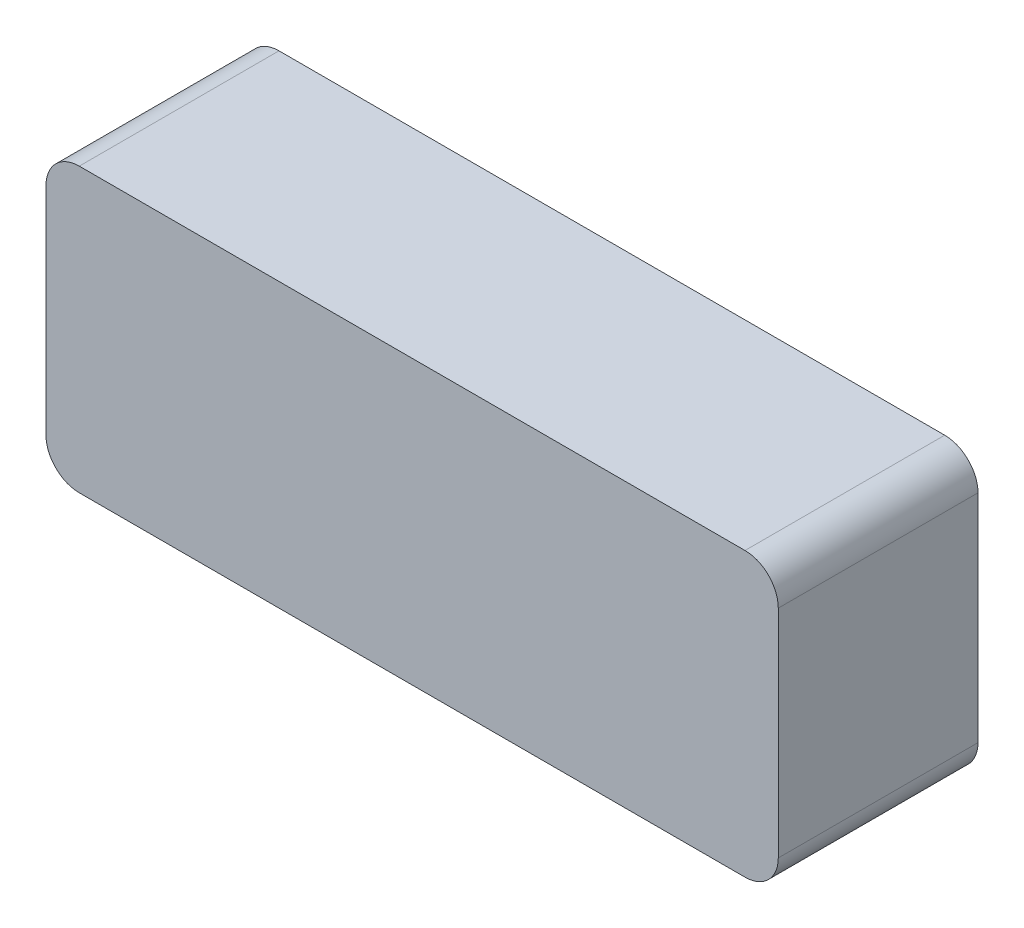
ISO-10303-21;
HEADER;
FILE_DESCRIPTION(('STEP AP214'),'2;1');
FILE_NAME('part.step','',(''),(''),'','','');
FILE_SCHEMA(('AUTOMOTIVE_DESIGN { 1 0 10303 214 1 1 1 1 }'));
ENDSEC;
DATA;
#1=APPLICATION_CONTEXT('core data for automotive mechanical design processes');
#2=APPLICATION_PROTOCOL_DEFINITION('international standard','automotive_design',2000,#1);
#3=PRODUCT_CONTEXT('',#1,'mechanical');
#4=PRODUCT('Part','Part','',(#3));
#5=PRODUCT_RELATED_PRODUCT_CATEGORY('part','',(#4));
#6=PRODUCT_DEFINITION_FORMATION('','',#4);
#7=PRODUCT_DEFINITION_CONTEXT('part definition',#1,'design');
#8=PRODUCT_DEFINITION('design','',#6,#7);
#9=PRODUCT_DEFINITION_SHAPE('','',#8);
#10=(LENGTH_UNIT() NAMED_UNIT(*) SI_UNIT(.MILLI.,.METRE.));
#11=(NAMED_UNIT(*) PLANE_ANGLE_UNIT() SI_UNIT($,.RADIAN.));
#12=(NAMED_UNIT(*) SI_UNIT($,.STERADIAN.) SOLID_ANGLE_UNIT());
#13=UNCERTAINTY_MEASURE_WITH_UNIT(LENGTH_MEASURE(1.E-05),#10,'distance_accuracy_value','');
#14=(GEOMETRIC_REPRESENTATION_CONTEXT(3) GLOBAL_UNCERTAINTY_ASSIGNED_CONTEXT((#13)) GLOBAL_UNIT_ASSIGNED_CONTEXT((#10,
#11,#12)) REPRESENTATION_CONTEXT('',''));
#15=CARTESIAN_POINT('',(0.,0.,0.));
#16=DIRECTION('',(0.,0.,1.));
#17=DIRECTION('',(1.,0.,0.));
#18=AXIS2_PLACEMENT_3D('',#15,#16,#17);
#19=CARTESIAN_POINT('',(0.,0.,12.));
#20=DIRECTION('',(1.,0.,0.));
#21=DIRECTION('',(0.,1.,0.));
#22=AXIS2_PLACEMENT_3D('',#19,#20,#21);
#23=PLANE('',#22);
#24=DIRECTION('',(0.,-1.,0.));
#25=VECTOR('',#24,1.);
#26=CARTESIAN_POINT('',(0.,0.,0.));
#27=LINE('',#26,#25);
#28=CARTESIAN_POINT('',(0.,-2.,0.));
#29=VERTEX_POINT('',#28);
#30=CARTESIAN_POINT('',(0.,-15.,0.));
#31=VERTEX_POINT('',#30);
#32=EDGE_CURVE('E140',#29,#31,#27,.T.);
#33=ORIENTED_EDGE('',*,*,#32,.T.);
#34=DIRECTION('',(0.,0.,-1.));
#35=VECTOR('',#34,1.);
#36=CARTESIAN_POINT('',(0.,-15.,12.));
#37=LINE('',#36,#35);
#38=CARTESIAN_POINT('',(0.,-15.,12.));
#39=VERTEX_POINT('',#38);
#40=EDGE_CURVE('E174',#31,#39,#37,.F.);
#41=ORIENTED_EDGE('',*,*,#40,.T.);
#42=DIRECTION('',(0.,-1.,0.));
#43=VECTOR('',#42,1.);
#44=CARTESIAN_POINT('',(0.,0.,12.));
#45=LINE('',#44,#43);
#46=CARTESIAN_POINT('',(0.,-2.,12.));
#47=VERTEX_POINT('',#46);
#48=EDGE_CURVE('E138',#47,#39,#45,.T.);
#49=ORIENTED_EDGE('',*,*,#48,.F.);
#50=DIRECTION('',(0.,0.,-1.));
#51=VECTOR('',#50,1.);
#52=CARTESIAN_POINT('',(0.,-2.,12.));
#53=LINE('',#52,#51);
#54=EDGE_CURVE('E170',#47,#29,#53,.T.);
#55=ORIENTED_EDGE('',*,*,#54,.T.);
#56=EDGE_LOOP('',(#33,#41,#49,#55));
#57=FACE_BOUND('',#56,.T.);
#58=ADVANCED_FACE('F39',(#57),#23,.F.);
#59=CARTESIAN_POINT('',(0.,-17.,12.));
#60=DIRECTION('',(0.,1.,0.));
#61=DIRECTION('',(0.,0.,1.));
#62=AXIS2_PLACEMENT_3D('',#59,#60,#61);
#63=PLANE('',#62);
#64=DIRECTION('',(1.,0.,0.));
#65=VECTOR('',#64,1.);
#66=CARTESIAN_POINT('',(0.,-17.,0.));
#67=LINE('',#66,#65);
#68=CARTESIAN_POINT('',(2.,-17.,0.));
#69=VERTEX_POINT('',#68);
#70=CARTESIAN_POINT('',(42.,-17.,0.));
#71=VERTEX_POINT('',#70);
#72=EDGE_CURVE('E134',#69,#71,#67,.T.);
#73=ORIENTED_EDGE('',*,*,#72,.T.);
#74=DIRECTION('',(0.,0.,-1.));
#75=VECTOR('',#74,1.);
#76=CARTESIAN_POINT('',(42.,-17.,12.));
#77=LINE('',#76,#75);
#78=CARTESIAN_POINT('',(42.,-17.,12.));
#79=VERTEX_POINT('',#78);
#80=EDGE_CURVE('E110',#71,#79,#77,.F.);
#81=ORIENTED_EDGE('',*,*,#80,.T.);
#82=DIRECTION('',(1.,0.,0.));
#83=VECTOR('',#82,1.);
#84=CARTESIAN_POINT('',(0.,-17.,12.));
#85=LINE('',#84,#83);
#86=CARTESIAN_POINT('',(2.,-17.,12.));
#87=VERTEX_POINT('',#86);
#88=EDGE_CURVE('E193',#87,#79,#85,.T.);
#89=ORIENTED_EDGE('',*,*,#88,.F.);
#90=DIRECTION('',(0.,0.,-1.));
#91=VECTOR('',#90,1.);
#92=CARTESIAN_POINT('',(2.,-17.,12.));
#93=LINE('',#92,#91);
#94=EDGE_CURVE('E116',#87,#69,#93,.T.);
#95=ORIENTED_EDGE('',*,*,#94,.T.);
#96=EDGE_LOOP('',(#73,#81,#89,#95));
#97=FACE_BOUND('',#96,.T.);
#98=ADVANCED_FACE('F214',(#97),#63,.F.);
#99=CARTESIAN_POINT('',(44.,0.,12.));
#100=DIRECTION('',(-1.,0.,0.));
#101=DIRECTION('',(0.,-1.,0.));
#102=AXIS2_PLACEMENT_3D('',#99,#100,#101);
#103=PLANE('',#102);
#104=DIRECTION('',(0.,1.,0.));
#105=VECTOR('',#104,1.);
#106=CARTESIAN_POINT('',(44.,0.,12.));
#107=LINE('',#106,#105);
#108=CARTESIAN_POINT('',(44.,-15.,12.));
#109=VERTEX_POINT('',#108);
#110=CARTESIAN_POINT('',(44.,-2.,12.));
#111=VERTEX_POINT('',#110);
#112=EDGE_CURVE('E125',#109,#111,#107,.T.);
#113=ORIENTED_EDGE('',*,*,#112,.F.);
#114=DIRECTION('',(0.,0.,-1.));
#115=VECTOR('',#114,1.);
#116=CARTESIAN_POINT('',(44.,-15.,12.));
#117=LINE('',#116,#115);
#118=CARTESIAN_POINT('',(44.,-15.,0.));
#119=VERTEX_POINT('',#118);
#120=EDGE_CURVE('E109',#109,#119,#117,.T.);
#121=ORIENTED_EDGE('',*,*,#120,.T.);
#122=DIRECTION('',(0.,1.,0.));
#123=VECTOR('',#122,1.);
#124=CARTESIAN_POINT('',(44.,0.,0.));
#125=LINE('',#124,#123);
#126=CARTESIAN_POINT('',(44.,-2.,0.));
#127=VERTEX_POINT('',#126);
#128=EDGE_CURVE('E123',#119,#127,#125,.T.);
#129=ORIENTED_EDGE('',*,*,#128,.T.);
#130=DIRECTION('',(0.,0.,-1.));
#131=VECTOR('',#130,1.);
#132=CARTESIAN_POINT('',(44.,-2.,12.));
#133=LINE('',#132,#131);
#134=EDGE_CURVE('E128',#127,#111,#133,.F.);
#135=ORIENTED_EDGE('',*,*,#134,.T.);
#136=EDGE_LOOP('',(#113,#121,#129,#135));
#137=FACE_BOUND('',#136,.T.);
#138=ADVANCED_FACE('F122',(#137),#103,.F.);
#139=CARTESIAN_POINT('',(0.,0.,12.));
#140=DIRECTION('',(0.,-1.,0.));
#141=DIRECTION('',(0.,0.,-1.));
#142=AXIS2_PLACEMENT_3D('',#139,#140,#141);
#143=PLANE('',#142);
#144=DIRECTION('',(-1.,0.,0.));
#145=VECTOR('',#144,1.);
#146=CARTESIAN_POINT('',(0.,0.,0.));
#147=LINE('',#146,#145);
#148=CARTESIAN_POINT('',(42.,0.,0.));
#149=VERTEX_POINT('',#148);
#150=CARTESIAN_POINT('',(2.,0.,0.));
#151=VERTEX_POINT('',#150);
#152=EDGE_CURVE('E133',#149,#151,#147,.T.);
#153=ORIENTED_EDGE('',*,*,#152,.T.);
#154=DIRECTION('',(0.,0.,-1.));
#155=VECTOR('',#154,1.);
#156=CARTESIAN_POINT('',(2.,0.,12.));
#157=LINE('',#156,#155);
#158=CARTESIAN_POINT('',(2.,0.,12.));
#159=VERTEX_POINT('',#158);
#160=EDGE_CURVE('E11',#151,#159,#157,.F.);
#161=ORIENTED_EDGE('',*,*,#160,.T.);
#162=DIRECTION('',(-1.,0.,0.));
#163=VECTOR('',#162,1.);
#164=CARTESIAN_POINT('',(0.,0.,12.));
#165=LINE('',#164,#163);
#166=CARTESIAN_POINT('',(42.,0.,12.));
#167=VERTEX_POINT('',#166);
#168=EDGE_CURVE('E145',#167,#159,#165,.T.);
#169=ORIENTED_EDGE('',*,*,#168,.F.);
#170=DIRECTION('',(0.,0.,-1.));
#171=VECTOR('',#170,1.);
#172=CARTESIAN_POINT('',(42.,0.,12.));
#173=LINE('',#172,#171);
#174=EDGE_CURVE('E48',#167,#149,#173,.T.);
#175=ORIENTED_EDGE('',*,*,#174,.T.);
#176=EDGE_LOOP('',(#153,#161,#169,#175));
#177=FACE_BOUND('',#176,.T.);
#178=ADVANCED_FACE('F179',(#177),#143,.F.);
#179=CARTESIAN_POINT('',(0.,0.,12.));
#180=DIRECTION('',(0.,0.,1.));
#181=DIRECTION('',(1.,0.,0.));
#182=AXIS2_PLACEMENT_3D('',#179,#180,#181);
#183=PLANE('',#182);
#184=ORIENTED_EDGE('',*,*,#88,.T.);
#185=CARTESIAN_POINT('',(42.,-15.,12.));
#186=DIRECTION('',(0.,0.,1.));
#187=DIRECTION('',(1.,0.,0.));
#188=AXIS2_PLACEMENT_3D('',#185,#186,#187);
#189=CIRCLE('',#188,2.);
#190=EDGE_CURVE('E167',#79,#109,#189,.T.);
#191=ORIENTED_EDGE('',*,*,#190,.T.);
#192=ORIENTED_EDGE('',*,*,#112,.T.);
#193=CARTESIAN_POINT('',(42.,-2.,12.));
#194=DIRECTION('',(0.,0.,1.));
#195=DIRECTION('',(1.,0.,0.));
#196=AXIS2_PLACEMENT_3D('',#193,#194,#195);
#197=CIRCLE('',#196,2.);
#198=EDGE_CURVE('E60',#111,#167,#197,.T.);
#199=ORIENTED_EDGE('',*,*,#198,.T.);
#200=ORIENTED_EDGE('',*,*,#168,.T.);
#201=CARTESIAN_POINT('',(2.,-2.,12.));
#202=DIRECTION('',(0.,0.,1.));
#203=DIRECTION('',(1.,0.,0.));
#204=AXIS2_PLACEMENT_3D('',#201,#202,#203);
#205=CIRCLE('',#204,2.);
#206=EDGE_CURVE('E161',#159,#47,#205,.T.);
#207=ORIENTED_EDGE('',*,*,#206,.T.);
#208=ORIENTED_EDGE('',*,*,#48,.T.);
#209=CARTESIAN_POINT('',(2.,-15.,12.));
#210=DIRECTION('',(0.,0.,1.));
#211=DIRECTION('',(1.,0.,0.));
#212=AXIS2_PLACEMENT_3D('',#209,#210,#211);
#213=CIRCLE('',#212,2.);
#214=EDGE_CURVE('E164',#39,#87,#213,.T.);
#215=ORIENTED_EDGE('',*,*,#214,.T.);
#216=EDGE_LOOP('',(#184,#191,#192,#199,#200,#207,#208,#215));
#217=FACE_BOUND('',#216,.T.);
#218=ADVANCED_FACE('F203',(#217),#183,.T.);
#219=CARTESIAN_POINT('',(0.,0.,0.));
#220=DIRECTION('',(0.,0.,1.));
#221=DIRECTION('',(1.,0.,0.));
#222=AXIS2_PLACEMENT_3D('',#219,#220,#221);
#223=PLANE('',#222);
#224=ORIENTED_EDGE('',*,*,#128,.F.);
#225=CARTESIAN_POINT('',(42.,-15.,0.));
#226=DIRECTION('',(0.,0.,1.));
#227=DIRECTION('',(1.,0.,0.));
#228=AXIS2_PLACEMENT_3D('',#225,#226,#227);
#229=CIRCLE('',#228,2.);
#230=EDGE_CURVE('E105',#119,#71,#229,.F.);
#231=ORIENTED_EDGE('',*,*,#230,.T.);
#232=ORIENTED_EDGE('',*,*,#72,.F.);
#233=CARTESIAN_POINT('',(2.,-15.,0.));
#234=DIRECTION('',(0.,0.,1.));
#235=DIRECTION('',(1.,0.,0.));
#236=AXIS2_PLACEMENT_3D('',#233,#234,#235);
#237=CIRCLE('',#236,2.);
#238=EDGE_CURVE('E117',#69,#31,#237,.F.);
#239=ORIENTED_EDGE('',*,*,#238,.T.);
#240=ORIENTED_EDGE('',*,*,#32,.F.);
#241=CARTESIAN_POINT('',(2.,-2.,0.));
#242=DIRECTION('',(0.,0.,1.));
#243=DIRECTION('',(1.,0.,0.));
#244=AXIS2_PLACEMENT_3D('',#241,#242,#243);
#245=CIRCLE('',#244,2.);
#246=EDGE_CURVE('E149',#29,#151,#245,.F.);
#247=ORIENTED_EDGE('',*,*,#246,.T.);
#248=ORIENTED_EDGE('',*,*,#152,.F.);
#249=CARTESIAN_POINT('',(42.,-2.,0.));
#250=DIRECTION('',(0.,0.,1.));
#251=DIRECTION('',(1.,0.,0.));
#252=AXIS2_PLACEMENT_3D('',#249,#250,#251);
#253=CIRCLE('',#252,2.);
#254=EDGE_CURVE('E127',#149,#127,#253,.F.);
#255=ORIENTED_EDGE('',*,*,#254,.T.);
#256=EDGE_LOOP('',(#224,#231,#232,#239,#240,#247,#248,#255));
#257=FACE_BOUND('',#256,.T.);
#258=ADVANCED_FACE('F130',(#257),#223,.F.);
#259=CARTESIAN_POINT('',(42.,-15.,12.));
#260=DIRECTION('',(0.,0.,-1.));
#261=DIRECTION('',(-1.,0.,0.));
#262=AXIS2_PLACEMENT_3D('',#259,#260,#261);
#263=CYLINDRICAL_SURFACE('',#262,2.);
#264=ORIENTED_EDGE('',*,*,#190,.F.);
#265=ORIENTED_EDGE('',*,*,#80,.F.);
#266=ORIENTED_EDGE('',*,*,#230,.F.);
#267=ORIENTED_EDGE('',*,*,#120,.F.);
#268=EDGE_LOOP('',(#264,#265,#266,#267));
#269=FACE_BOUND('',#268,.T.);
#270=ADVANCED_FACE('F108',(#269),#263,.T.);
#271=CARTESIAN_POINT('',(2.,-15.,12.));
#272=DIRECTION('',(0.,0.,-1.));
#273=DIRECTION('',(-1.,0.,0.));
#274=AXIS2_PLACEMENT_3D('',#271,#272,#273);
#275=CYLINDRICAL_SURFACE('',#274,2.);
#276=ORIENTED_EDGE('',*,*,#214,.F.);
#277=ORIENTED_EDGE('',*,*,#40,.F.);
#278=ORIENTED_EDGE('',*,*,#238,.F.);
#279=ORIENTED_EDGE('',*,*,#94,.F.);
#280=EDGE_LOOP('',(#276,#277,#278,#279));
#281=FACE_BOUND('',#280,.T.);
#282=ADVANCED_FACE('F225',(#281),#275,.T.);
#283=CARTESIAN_POINT('',(2.,-2.,12.));
#284=DIRECTION('',(0.,0.,-1.));
#285=DIRECTION('',(-1.,0.,0.));
#286=AXIS2_PLACEMENT_3D('',#283,#284,#285);
#287=CYLINDRICAL_SURFACE('',#286,2.);
#288=ORIENTED_EDGE('',*,*,#206,.F.);
#289=ORIENTED_EDGE('',*,*,#160,.F.);
#290=ORIENTED_EDGE('',*,*,#246,.F.);
#291=ORIENTED_EDGE('',*,*,#54,.F.);
#292=EDGE_LOOP('',(#288,#289,#290,#291));
#293=FACE_BOUND('',#292,.T.);
#294=ADVANCED_FACE('F186',(#293),#287,.T.);
#295=CARTESIAN_POINT('',(42.,-2.,12.));
#296=DIRECTION('',(0.,0.,-1.));
#297=DIRECTION('',(-1.,0.,0.));
#298=AXIS2_PLACEMENT_3D('',#295,#296,#297);
#299=CYLINDRICAL_SURFACE('',#298,2.);
#300=ORIENTED_EDGE('',*,*,#198,.F.);
#301=ORIENTED_EDGE('',*,*,#134,.F.);
#302=ORIENTED_EDGE('',*,*,#254,.F.);
#303=ORIENTED_EDGE('',*,*,#174,.F.);
#304=EDGE_LOOP('',(#300,#301,#302,#303));
#305=FACE_BOUND('',#304,.T.);
#306=ADVANCED_FACE('F41',(#305),#299,.T.);
#307=CLOSED_SHELL('',(#58,#98,#138,#178,#218,#258,#270,#282,#294,#306));
#308=MANIFOLD_SOLID_BREP('B2',#307);
#309=ADVANCED_BREP_SHAPE_REPRESENTATION('',(#18,#308),#14);
#310=SHAPE_DEFINITION_REPRESENTATION(#9,#309);
ENDSEC;
END-ISO-10303-21;
